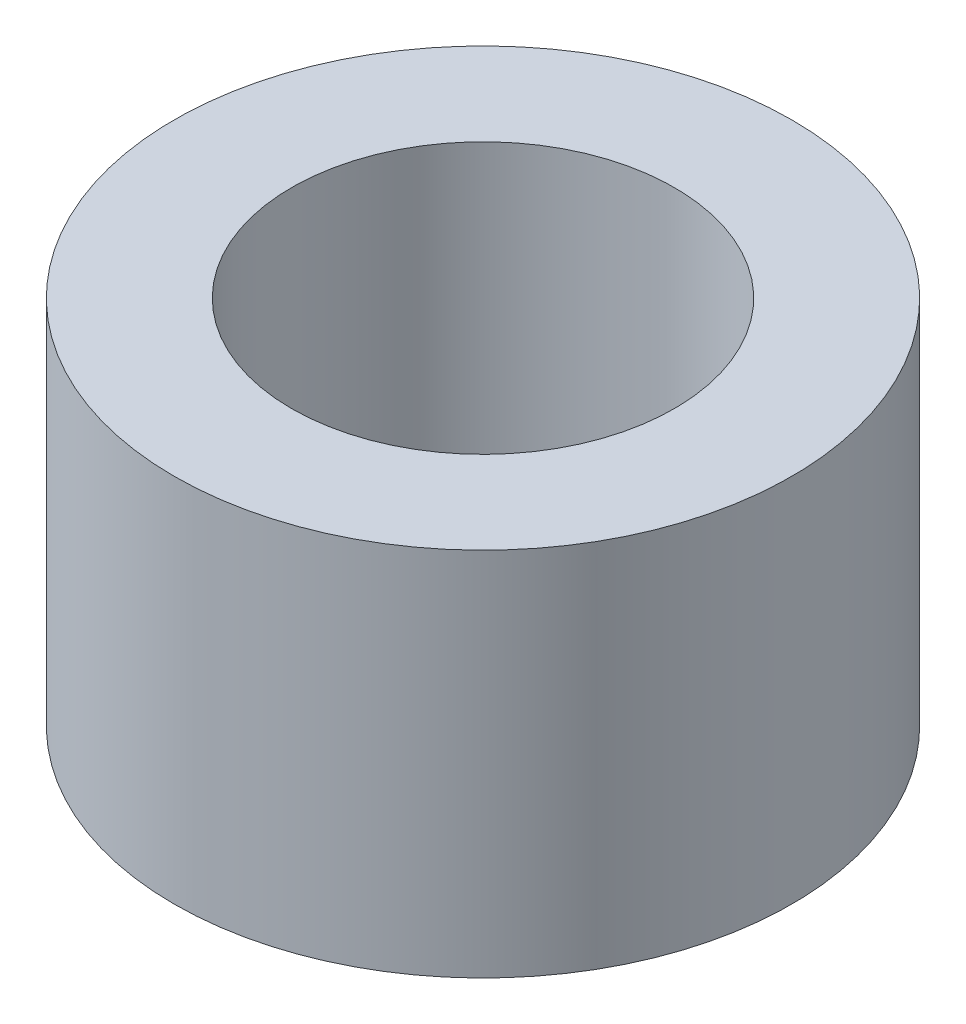
ISO-10303-21;
HEADER;
FILE_DESCRIPTION(('STEP AP214'),'2;1');
FILE_NAME('part.step','',(''),(''),'','','');
FILE_SCHEMA(('AUTOMOTIVE_DESIGN { 1 0 10303 214 1 1 1 1 }'));
ENDSEC;
DATA;
#1=APPLICATION_CONTEXT('core data for automotive mechanical design processes');
#2=APPLICATION_PROTOCOL_DEFINITION('international standard','automotive_design',2000,#1);
#3=PRODUCT_CONTEXT('',#1,'mechanical');
#4=PRODUCT('Part','Part','',(#3));
#5=PRODUCT_RELATED_PRODUCT_CATEGORY('part','',(#4));
#6=PRODUCT_DEFINITION_FORMATION('','',#4);
#7=PRODUCT_DEFINITION_CONTEXT('part definition',#1,'design');
#8=PRODUCT_DEFINITION('design','',#6,#7);
#9=PRODUCT_DEFINITION_SHAPE('','',#8);
#10=(LENGTH_UNIT() NAMED_UNIT(*) SI_UNIT(.MILLI.,.METRE.));
#11=(NAMED_UNIT(*) PLANE_ANGLE_UNIT() SI_UNIT($,.RADIAN.));
#12=(NAMED_UNIT(*) SI_UNIT($,.STERADIAN.) SOLID_ANGLE_UNIT());
#13=UNCERTAINTY_MEASURE_WITH_UNIT(LENGTH_MEASURE(1.E-05),#10,'distance_accuracy_value','');
#14=(GEOMETRIC_REPRESENTATION_CONTEXT(3) GLOBAL_UNCERTAINTY_ASSIGNED_CONTEXT((#13)) GLOBAL_UNIT_ASSIGNED_CONTEXT((#10,
#11,#12)) REPRESENTATION_CONTEXT('',''));
#15=CARTESIAN_POINT('',(0.,0.,0.));
#16=DIRECTION('',(0.,0.,1.));
#17=DIRECTION('',(1.,0.,0.));
#18=AXIS2_PLACEMENT_3D('',#15,#16,#17);
#19=CARTESIAN_POINT('',(0.,3.,0.));
#20=DIRECTION('',(0.,1.,0.));
#21=DIRECTION('',(0.,0.,1.));
#22=AXIS2_PLACEMENT_3D('',#19,#20,#21);
#23=PLANE('',#22);
#24=CARTESIAN_POINT('',(0.,3.,0.));
#25=DIRECTION('',(0.,1.,0.));
#26=DIRECTION('',(0.,0.,1.));
#27=AXIS2_PLACEMENT_3D('',#24,#25,#26);
#28=CIRCLE('',#27,2.5);
#29=CARTESIAN_POINT('',(0.,3.,2.5));
#30=VERTEX_POINT('',#29);
#31=EDGE_CURVE('E10',#30,#30,#28,.T.);
#32=ORIENTED_EDGE('',*,*,#31,.T.);
#33=EDGE_LOOP('',(#32));
#34=FACE_BOUND('',#33,.T.);
#35=CARTESIAN_POINT('',(0.,3.,0.));
#36=DIRECTION('',(0.,1.,0.));
#37=DIRECTION('',(0.,0.,1.));
#38=AXIS2_PLACEMENT_3D('',#35,#36,#37);
#39=CIRCLE('',#38,1.55);
#40=CARTESIAN_POINT('',(0.,3.,1.55));
#41=VERTEX_POINT('',#40);
#42=EDGE_CURVE('E43',#41,#41,#39,.T.);
#43=ORIENTED_EDGE('',*,*,#42,.F.);
#44=EDGE_LOOP('',(#43));
#45=FACE_BOUND('',#44,.T.);
#46=ADVANCED_FACE('F32',(#34,#45),#23,.T.);
#47=CARTESIAN_POINT('',(0.,0.,0.));
#48=DIRECTION('',(0.,1.,0.));
#49=DIRECTION('',(0.,0.,1.));
#50=AXIS2_PLACEMENT_3D('',#47,#48,#49);
#51=PLANE('',#50);
#52=CARTESIAN_POINT('',(0.,0.,0.));
#53=DIRECTION('',(0.,1.,0.));
#54=DIRECTION('',(0.,0.,1.));
#55=AXIS2_PLACEMENT_3D('',#52,#53,#54);
#56=CIRCLE('',#55,2.5);
#57=CARTESIAN_POINT('',(0.,0.,2.5));
#58=VERTEX_POINT('',#57);
#59=EDGE_CURVE('E36',#58,#58,#56,.T.);
#60=ORIENTED_EDGE('',*,*,#59,.F.);
#61=EDGE_LOOP('',(#60));
#62=FACE_BOUND('',#61,.T.);
#63=CARTESIAN_POINT('',(0.,0.,0.));
#64=DIRECTION('',(0.,1.,0.));
#65=DIRECTION('',(0.,0.,1.));
#66=AXIS2_PLACEMENT_3D('',#63,#64,#65);
#67=CIRCLE('',#66,1.55);
#68=CARTESIAN_POINT('',(0.,0.,1.55));
#69=VERTEX_POINT('',#68);
#70=EDGE_CURVE('E45',#69,#69,#67,.T.);
#71=ORIENTED_EDGE('',*,*,#70,.T.);
#72=EDGE_LOOP('',(#71));
#73=FACE_BOUND('',#72,.T.);
#74=ADVANCED_FACE('F55',(#62,#73),#51,.F.);
#75=CARTESIAN_POINT('',(0.,3.,0.));
#76=DIRECTION('',(0.,-1.,0.));
#77=DIRECTION('',(0.,0.,-1.));
#78=AXIS2_PLACEMENT_3D('',#75,#76,#77);
#79=CYLINDRICAL_SURFACE('',#78,2.5);
#80=ORIENTED_EDGE('',*,*,#31,.F.);
#81=EDGE_LOOP('',(#80));
#82=FACE_BOUND('',#81,.T.);
#83=ORIENTED_EDGE('',*,*,#59,.T.);
#84=EDGE_LOOP('',(#83));
#85=FACE_BOUND('',#84,.T.);
#86=ADVANCED_FACE('F34',(#82,#85),#79,.T.);
#87=CARTESIAN_POINT('',(0.,3.,0.));
#88=DIRECTION('',(0.,-1.,0.));
#89=DIRECTION('',(0.,0.,-1.));
#90=AXIS2_PLACEMENT_3D('',#87,#88,#89);
#91=CYLINDRICAL_SURFACE('',#90,1.55);
#92=ORIENTED_EDGE('',*,*,#42,.T.);
#93=EDGE_LOOP('',(#92));
#94=FACE_BOUND('',#93,.T.);
#95=ORIENTED_EDGE('',*,*,#70,.F.);
#96=EDGE_LOOP('',(#95));
#97=FACE_BOUND('',#96,.T.);
#98=ADVANCED_FACE('F51',(#94,#97),#91,.F.);
#99=CLOSED_SHELL('',(#46,#74,#86,#98));
#100=MANIFOLD_SOLID_BREP('B2',#99);
#101=ADVANCED_BREP_SHAPE_REPRESENTATION('',(#18,#100),#14);
#102=SHAPE_DEFINITION_REPRESENTATION(#9,#101);
ENDSEC;
END-ISO-10303-21;
